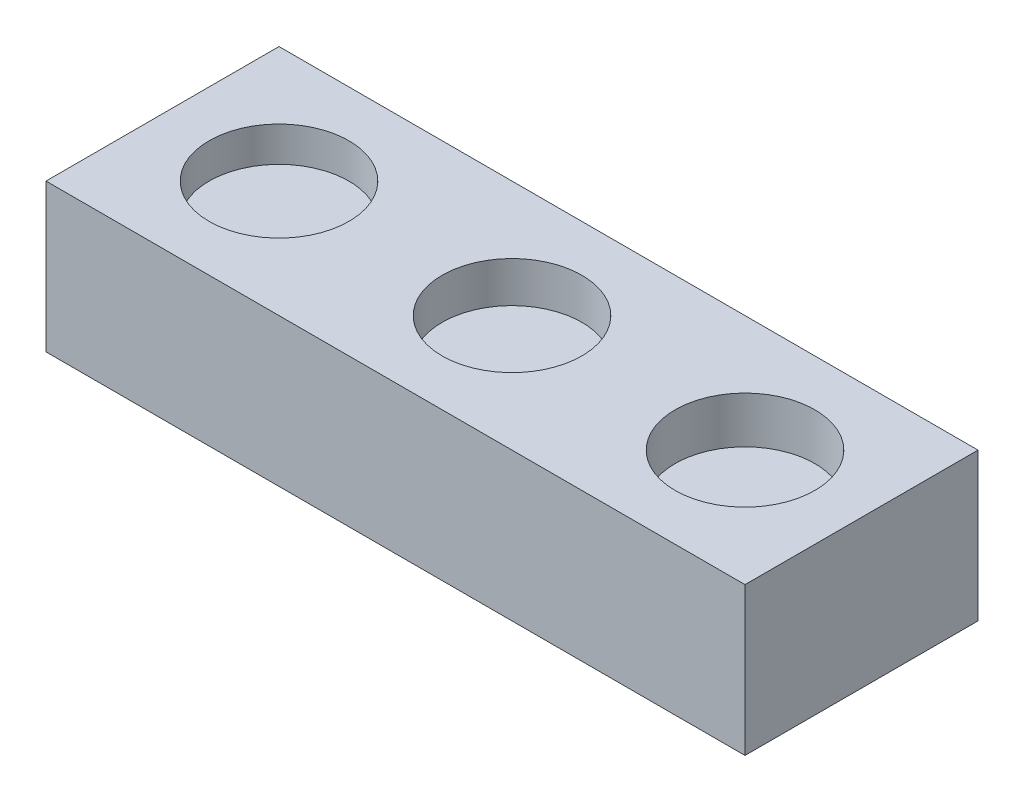
ISO-10303-21;
HEADER;
FILE_DESCRIPTION(('STEP AP214'),'2;1');
FILE_NAME('part.step','',(''),(''),'','','');
FILE_SCHEMA(('AUTOMOTIVE_DESIGN { 1 0 10303 214 1 1 1 1 }'));
ENDSEC;
DATA;
#1=APPLICATION_CONTEXT('core data for automotive mechanical design processes');
#2=APPLICATION_PROTOCOL_DEFINITION('international standard','automotive_design',2000,#1);
#3=PRODUCT_CONTEXT('',#1,'mechanical');
#4=PRODUCT('Part','Part','',(#3));
#5=PRODUCT_RELATED_PRODUCT_CATEGORY('part','',(#4));
#6=PRODUCT_DEFINITION_FORMATION('','',#4);
#7=PRODUCT_DEFINITION_CONTEXT('part definition',#1,'design');
#8=PRODUCT_DEFINITION('design','',#6,#7);
#9=PRODUCT_DEFINITION_SHAPE('','',#8);
#10=(LENGTH_UNIT() NAMED_UNIT(*) SI_UNIT(.MILLI.,.METRE.));
#11=(NAMED_UNIT(*) PLANE_ANGLE_UNIT() SI_UNIT($,.RADIAN.));
#12=(NAMED_UNIT(*) SI_UNIT($,.STERADIAN.) SOLID_ANGLE_UNIT());
#13=UNCERTAINTY_MEASURE_WITH_UNIT(LENGTH_MEASURE(1.E-05),#10,'distance_accuracy_value','');
#14=(GEOMETRIC_REPRESENTATION_CONTEXT(3) GLOBAL_UNCERTAINTY_ASSIGNED_CONTEXT((#13)) GLOBAL_UNIT_ASSIGNED_CONTEXT((#10,
#11,#12)) REPRESENTATION_CONTEXT('',''));
#15=CARTESIAN_POINT('',(0.,0.,0.));
#16=DIRECTION('',(0.,0.,1.));
#17=DIRECTION('',(1.,0.,0.));
#18=AXIS2_PLACEMENT_3D('',#15,#16,#17);
#19=CARTESIAN_POINT('',(0.,6.35,0.));
#20=DIRECTION('',(1.,0.,0.));
#21=DIRECTION('',(0.,0.,-1.));
#22=AXIS2_PLACEMENT_3D('',#19,#20,#21);
#23=PLANE('',#22);
#24=DIRECTION('',(0.,0.,1.));
#25=VECTOR('',#24,1.);
#26=CARTESIAN_POINT('',(0.,0.,0.));
#27=LINE('',#26,#25);
#28=CARTESIAN_POINT('',(0.,0.,-10.));
#29=VERTEX_POINT('',#28);
#30=CARTESIAN_POINT('',(0.,0.,0.));
#31=VERTEX_POINT('',#30);
#32=EDGE_CURVE('E113',#29,#31,#27,.T.);
#33=ORIENTED_EDGE('',*,*,#32,.T.);
#34=DIRECTION('',(0.,-1.,0.));
#35=VECTOR('',#34,1.);
#36=CARTESIAN_POINT('',(0.,6.35,0.));
#37=LINE('',#36,#35);
#38=CARTESIAN_POINT('',(0.,6.35,0.));
#39=VERTEX_POINT('',#38);
#40=EDGE_CURVE('E11',#39,#31,#37,.T.);
#41=ORIENTED_EDGE('',*,*,#40,.F.);
#42=DIRECTION('',(0.,0.,1.));
#43=VECTOR('',#42,1.);
#44=CARTESIAN_POINT('',(0.,6.35,0.));
#45=LINE('',#44,#43);
#46=CARTESIAN_POINT('',(0.,6.35,-10.));
#47=VERTEX_POINT('',#46);
#48=EDGE_CURVE('E97',#47,#39,#45,.T.);
#49=ORIENTED_EDGE('',*,*,#48,.F.);
#50=DIRECTION('',(0.,-1.,0.));
#51=VECTOR('',#50,1.);
#52=CARTESIAN_POINT('',(0.,6.35,-10.));
#53=LINE('',#52,#51);
#54=EDGE_CURVE('E109',#47,#29,#53,.T.);
#55=ORIENTED_EDGE('',*,*,#54,.T.);
#56=EDGE_LOOP('',(#33,#41,#49,#55));
#57=FACE_BOUND('',#56,.T.);
#58=ADVANCED_FACE('F45',(#57),#23,.F.);
#59=CARTESIAN_POINT('',(0.,6.35,0.));
#60=DIRECTION('',(0.,0.,-1.));
#61=DIRECTION('',(-1.,0.,0.));
#62=AXIS2_PLACEMENT_3D('',#59,#60,#61);
#63=PLANE('',#62);
#64=DIRECTION('',(1.,0.,0.));
#65=VECTOR('',#64,1.);
#66=CARTESIAN_POINT('',(0.,0.,0.));
#67=LINE('',#66,#65);
#68=CARTESIAN_POINT('',(30.,0.,0.));
#69=VERTEX_POINT('',#68);
#70=EDGE_CURVE('E102',#31,#69,#67,.T.);
#71=ORIENTED_EDGE('',*,*,#70,.T.);
#72=DIRECTION('',(0.,-1.,0.));
#73=VECTOR('',#72,1.);
#74=CARTESIAN_POINT('',(30.,6.35,0.));
#75=LINE('',#74,#73);
#76=CARTESIAN_POINT('',(30.,6.35,0.));
#77=VERTEX_POINT('',#76);
#78=EDGE_CURVE('E54',#77,#69,#75,.T.);
#79=ORIENTED_EDGE('',*,*,#78,.F.);
#80=DIRECTION('',(1.,0.,0.));
#81=VECTOR('',#80,1.);
#82=CARTESIAN_POINT('',(0.,6.35,0.));
#83=LINE('',#82,#81);
#84=EDGE_CURVE('E92',#39,#77,#83,.T.);
#85=ORIENTED_EDGE('',*,*,#84,.F.);
#86=ORIENTED_EDGE('',*,*,#40,.T.);
#87=EDGE_LOOP('',(#71,#79,#85,#86));
#88=FACE_BOUND('',#87,.T.);
#89=ADVANCED_FACE('F101',(#88),#63,.F.);
#90=CARTESIAN_POINT('',(30.,6.35,0.));
#91=DIRECTION('',(-1.,0.,0.));
#92=DIRECTION('',(0.,0.,1.));
#93=AXIS2_PLACEMENT_3D('',#90,#91,#92);
#94=PLANE('',#93);
#95=DIRECTION('',(0.,0.,-1.));
#96=VECTOR('',#95,1.);
#97=CARTESIAN_POINT('',(30.,0.,0.));
#98=LINE('',#97,#96);
#99=CARTESIAN_POINT('',(30.,0.,-10.));
#100=VERTEX_POINT('',#99);
#101=EDGE_CURVE('E79',#69,#100,#98,.T.);
#102=ORIENTED_EDGE('',*,*,#101,.T.);
#103=DIRECTION('',(0.,-1.,0.));
#104=VECTOR('',#103,1.);
#105=CARTESIAN_POINT('',(30.,6.35,-10.));
#106=LINE('',#105,#104);
#107=CARTESIAN_POINT('',(30.,6.35,-10.));
#108=VERTEX_POINT('',#107);
#109=EDGE_CURVE('E104',#108,#100,#106,.T.);
#110=ORIENTED_EDGE('',*,*,#109,.F.);
#111=DIRECTION('',(0.,0.,-1.));
#112=VECTOR('',#111,1.);
#113=CARTESIAN_POINT('',(30.,6.35,0.));
#114=LINE('',#113,#112);
#115=EDGE_CURVE('E95',#77,#108,#114,.T.);
#116=ORIENTED_EDGE('',*,*,#115,.F.);
#117=ORIENTED_EDGE('',*,*,#78,.T.);
#118=EDGE_LOOP('',(#102,#110,#116,#117));
#119=FACE_BOUND('',#118,.T.);
#120=ADVANCED_FACE('F105',(#119),#94,.F.);
#121=CARTESIAN_POINT('',(0.,6.35,-10.));
#122=DIRECTION('',(0.,0.,1.));
#123=DIRECTION('',(1.,0.,0.));
#124=AXIS2_PLACEMENT_3D('',#121,#122,#123);
#125=PLANE('',#124);
#126=DIRECTION('',(-1.,0.,0.));
#127=VECTOR('',#126,1.);
#128=CARTESIAN_POINT('',(0.,0.,-10.));
#129=LINE('',#128,#127);
#130=EDGE_CURVE('E85',#100,#29,#129,.T.);
#131=ORIENTED_EDGE('',*,*,#130,.T.);
#132=ORIENTED_EDGE('',*,*,#54,.F.);
#133=DIRECTION('',(-1.,0.,0.));
#134=VECTOR('',#133,1.);
#135=CARTESIAN_POINT('',(0.,6.35,-10.));
#136=LINE('',#135,#134);
#137=EDGE_CURVE('E62',#108,#47,#136,.T.);
#138=ORIENTED_EDGE('',*,*,#137,.F.);
#139=ORIENTED_EDGE('',*,*,#109,.T.);
#140=EDGE_LOOP('',(#131,#132,#138,#139));
#141=FACE_BOUND('',#140,.T.);
#142=ADVANCED_FACE('F127',(#141),#125,.F.);
#143=CARTESIAN_POINT('',(0.,6.35,0.));
#144=DIRECTION('',(0.,-1.,0.));
#145=DIRECTION('',(0.,0.,-1.));
#146=AXIS2_PLACEMENT_3D('',#143,#144,#145);
#147=PLANE('',#146);
#148=CARTESIAN_POINT('',(25.,6.35,-5.));
#149=DIRECTION('',(0.,1.,0.));
#150=DIRECTION('',(0.,0.,1.));
#151=AXIS2_PLACEMENT_3D('',#148,#149,#150);
#152=CIRCLE('',#151,2.99999999999999);
#153=CARTESIAN_POINT('',(25.,6.35,-2.00000000000001));
#154=VERTEX_POINT('',#153);
#155=EDGE_CURVE('E150',#154,#154,#152,.T.);
#156=ORIENTED_EDGE('',*,*,#155,.F.);
#157=EDGE_LOOP('',(#156));
#158=FACE_BOUND('',#157,.T.);
#159=CARTESIAN_POINT('',(5.,6.35,-5.));
#160=DIRECTION('',(0.,1.,0.));
#161=DIRECTION('',(0.,0.,1.));
#162=AXIS2_PLACEMENT_3D('',#159,#160,#161);
#163=CIRCLE('',#162,3.);
#164=CARTESIAN_POINT('',(5.,6.35,-2.));
#165=VERTEX_POINT('',#164);
#166=EDGE_CURVE('E142',#165,#165,#163,.T.);
#167=ORIENTED_EDGE('',*,*,#166,.F.);
#168=EDGE_LOOP('',(#167));
#169=FACE_BOUND('',#168,.T.);
#170=CARTESIAN_POINT('',(15.,6.35,-5.));
#171=DIRECTION('',(0.,1.,0.));
#172=DIRECTION('',(0.,0.,1.));
#173=AXIS2_PLACEMENT_3D('',#170,#171,#172);
#174=CIRCLE('',#173,3.);
#175=CARTESIAN_POINT('',(15.,6.35,-2.));
#176=VERTEX_POINT('',#175);
#177=EDGE_CURVE('E134',#176,#176,#174,.T.);
#178=ORIENTED_EDGE('',*,*,#177,.F.);
#179=EDGE_LOOP('',(#178));
#180=FACE_BOUND('',#179,.T.);
#181=ORIENTED_EDGE('',*,*,#48,.T.);
#182=ORIENTED_EDGE('',*,*,#84,.T.);
#183=ORIENTED_EDGE('',*,*,#115,.T.);
#184=ORIENTED_EDGE('',*,*,#137,.T.);
#185=EDGE_LOOP('',(#181,#182,#183,#184));
#186=FACE_BOUND('',#185,.T.);
#187=ADVANCED_FACE('F93',(#158,#169,#180,#186),#147,.F.);
#188=CARTESIAN_POINT('',(0.,0.,0.));
#189=DIRECTION('',(0.,-1.,0.));
#190=DIRECTION('',(0.,0.,-1.));
#191=AXIS2_PLACEMENT_3D('',#188,#189,#190);
#192=PLANE('',#191);
#193=ORIENTED_EDGE('',*,*,#32,.F.);
#194=ORIENTED_EDGE('',*,*,#130,.F.);
#195=ORIENTED_EDGE('',*,*,#101,.F.);
#196=ORIENTED_EDGE('',*,*,#70,.F.);
#197=EDGE_LOOP('',(#193,#194,#195,#196));
#198=FACE_BOUND('',#197,.T.);
#199=ADVANCED_FACE('F130',(#198),#192,.T.);
#200=CARTESIAN_POINT('',(15.,4.6,-5.));
#201=DIRECTION('',(0.,1.,0.));
#202=DIRECTION('',(0.,0.,1.));
#203=AXIS2_PLACEMENT_3D('',#200,#201,#202);
#204=CYLINDRICAL_SURFACE('',#203,3.);
#205=CARTESIAN_POINT('',(15.,4.6,-5.));
#206=DIRECTION('',(0.,1.,0.));
#207=DIRECTION('',(0.,0.,1.));
#208=AXIS2_PLACEMENT_3D('',#205,#206,#207);
#209=CIRCLE('',#208,3.);
#210=CARTESIAN_POINT('',(15.,4.6,-2.));
#211=VERTEX_POINT('',#210);
#212=EDGE_CURVE('E117',#211,#211,#209,.T.);
#213=ORIENTED_EDGE('',*,*,#212,.F.);
#214=EDGE_LOOP('',(#213));
#215=FACE_BOUND('',#214,.T.);
#216=ORIENTED_EDGE('',*,*,#177,.T.);
#217=EDGE_LOOP('',(#216));
#218=FACE_BOUND('',#217,.T.);
#219=ADVANCED_FACE('F174',(#215,#218),#204,.F.);
#220=CARTESIAN_POINT('',(15.,4.6,-5.));
#221=DIRECTION('',(0.,1.,0.));
#222=DIRECTION('',(0.,0.,1.));
#223=AXIS2_PLACEMENT_3D('',#220,#221,#222);
#224=PLANE('',#223);
#225=ORIENTED_EDGE('',*,*,#212,.T.);
#226=EDGE_LOOP('',(#225));
#227=FACE_BOUND('',#226,.T.);
#228=ADVANCED_FACE('F176',(#227),#224,.T.);
#229=CARTESIAN_POINT('',(5.,4.85,-5.));
#230=DIRECTION('',(0.,1.,0.));
#231=DIRECTION('',(0.,0.,1.));
#232=AXIS2_PLACEMENT_3D('',#229,#230,#231);
#233=CYLINDRICAL_SURFACE('',#232,3.);
#234=CARTESIAN_POINT('',(5.,4.85,-5.));
#235=DIRECTION('',(0.,1.,0.));
#236=DIRECTION('',(0.,0.,1.));
#237=AXIS2_PLACEMENT_3D('',#234,#235,#236);
#238=CIRCLE('',#237,3.);
#239=CARTESIAN_POINT('',(5.,4.85,-2.));
#240=VERTEX_POINT('',#239);
#241=EDGE_CURVE('E138',#240,#240,#238,.T.);
#242=ORIENTED_EDGE('',*,*,#241,.F.);
#243=EDGE_LOOP('',(#242));
#244=FACE_BOUND('',#243,.T.);
#245=ORIENTED_EDGE('',*,*,#166,.T.);
#246=EDGE_LOOP('',(#245));
#247=FACE_BOUND('',#246,.T.);
#248=ADVANCED_FACE('F183',(#244,#247),#233,.F.);
#249=CARTESIAN_POINT('',(5.,4.85,-5.));
#250=DIRECTION('',(0.,1.,0.));
#251=DIRECTION('',(0.,0.,1.));
#252=AXIS2_PLACEMENT_3D('',#249,#250,#251);
#253=PLANE('',#252);
#254=ORIENTED_EDGE('',*,*,#241,.T.);
#255=EDGE_LOOP('',(#254));
#256=FACE_BOUND('',#255,.T.);
#257=ADVANCED_FACE('F163',(#256),#253,.T.);
#258=CARTESIAN_POINT('',(25.,4.35,-5.));
#259=DIRECTION('',(0.,1.,0.));
#260=DIRECTION('',(0.,0.,1.));
#261=AXIS2_PLACEMENT_3D('',#258,#259,#260);
#262=CYLINDRICAL_SURFACE('',#261,2.99999999999999);
#263=CARTESIAN_POINT('',(25.,4.35,-5.));
#264=DIRECTION('',(0.,1.,0.));
#265=DIRECTION('',(0.,0.,1.));
#266=AXIS2_PLACEMENT_3D('',#263,#264,#265);
#267=CIRCLE('',#266,2.99999999999999);
#268=CARTESIAN_POINT('',(25.,4.35,-2.00000000000001));
#269=VERTEX_POINT('',#268);
#270=EDGE_CURVE('E146',#269,#269,#267,.T.);
#271=ORIENTED_EDGE('',*,*,#270,.F.);
#272=EDGE_LOOP('',(#271));
#273=FACE_BOUND('',#272,.T.);
#274=ORIENTED_EDGE('',*,*,#155,.T.);
#275=EDGE_LOOP('',(#274));
#276=FACE_BOUND('',#275,.T.);
#277=ADVANCED_FACE('F160',(#273,#276),#262,.F.);
#278=CARTESIAN_POINT('',(25.,4.35,-5.));
#279=DIRECTION('',(0.,1.,0.));
#280=DIRECTION('',(0.,0.,1.));
#281=AXIS2_PLACEMENT_3D('',#278,#279,#280);
#282=PLANE('',#281);
#283=ORIENTED_EDGE('',*,*,#270,.T.);
#284=EDGE_LOOP('',(#283));
#285=FACE_BOUND('',#284,.T.);
#286=ADVANCED_FACE('F158',(#285),#282,.T.);
#287=CLOSED_SHELL('',(#58,#89,#120,#142,#187,#199,#219,#228,#248,#257,#277,#286));
#288=MANIFOLD_SOLID_BREP('B2',#287);
#289=ADVANCED_BREP_SHAPE_REPRESENTATION('',(#18,#288),#14);
#290=SHAPE_DEFINITION_REPRESENTATION(#9,#289);
ENDSEC;
END-ISO-10303-21;
